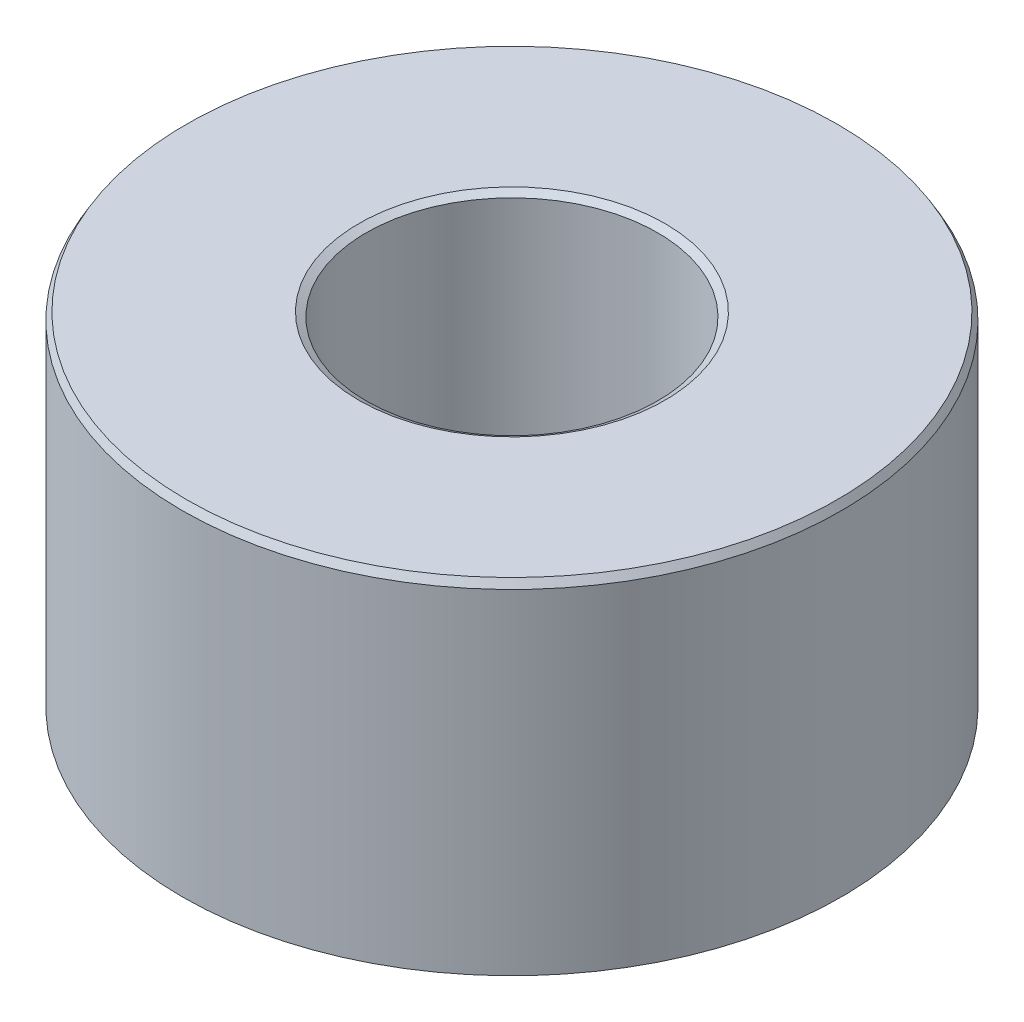
ISO-10303-21;
HEADER;
FILE_DESCRIPTION(('STEP AP214'),'2;1');
FILE_NAME('part.step','',(''),(''),'','','');
FILE_SCHEMA(('AUTOMOTIVE_DESIGN { 1 0 10303 214 1 1 1 1 }'));
ENDSEC;
DATA;
#1=APPLICATION_CONTEXT('core data for automotive mechanical design processes');
#2=APPLICATION_PROTOCOL_DEFINITION('international standard','automotive_design',2000,#1);
#3=PRODUCT_CONTEXT('',#1,'mechanical');
#4=PRODUCT('Part','Part','',(#3));
#5=PRODUCT_RELATED_PRODUCT_CATEGORY('part','',(#4));
#6=PRODUCT_DEFINITION_FORMATION('','',#4);
#7=PRODUCT_DEFINITION_CONTEXT('part definition',#1,'design');
#8=PRODUCT_DEFINITION('design','',#6,#7);
#9=PRODUCT_DEFINITION_SHAPE('','',#8);
#10=(LENGTH_UNIT() NAMED_UNIT(*) SI_UNIT(.MILLI.,.METRE.));
#11=(NAMED_UNIT(*) PLANE_ANGLE_UNIT() SI_UNIT($,.RADIAN.));
#12=(NAMED_UNIT(*) SI_UNIT($,.STERADIAN.) SOLID_ANGLE_UNIT());
#13=UNCERTAINTY_MEASURE_WITH_UNIT(LENGTH_MEASURE(1.E-05),#10,'distance_accuracy_value','');
#14=(GEOMETRIC_REPRESENTATION_CONTEXT(3) GLOBAL_UNCERTAINTY_ASSIGNED_CONTEXT((#13)) GLOBAL_UNIT_ASSIGNED_CONTEXT((#10,
#11,#12)) REPRESENTATION_CONTEXT('',''));
#15=CARTESIAN_POINT('',(0.,0.,0.));
#16=DIRECTION('',(0.,0.,1.));
#17=DIRECTION('',(1.,0.,0.));
#18=AXIS2_PLACEMENT_3D('',#15,#16,#17);
#19=CARTESIAN_POINT('',(0.,44.6371348928676,0.));
#20=DIRECTION('',(0.,-1.,0.));
#21=DIRECTION('',(0.,0.,-1.));
#22=AXIS2_PLACEMENT_3D('',#19,#20,#21);
#23=CYLINDRICAL_SURFACE('',#22,42.5);
#24=CARTESIAN_POINT('',(0.,0.548543792690093,0.));
#25=DIRECTION('',(0.,1.,0.));
#26=DIRECTION('',(0.,0.,1.));
#27=AXIS2_PLACEMENT_3D('',#24,#25,#26);
#28=CIRCLE('',#27,42.5);
#29=CARTESIAN_POINT('',(0.,0.548543792690093,42.5));
#30=VERTEX_POINT('',#29);
#31=EDGE_CURVE('E10',#30,#30,#28,.T.);
#32=ORIENTED_EDGE('',*,*,#31,.T.);
#33=EDGE_LOOP('',(#32));
#34=FACE_BOUND('',#33,.T.);
#35=CARTESIAN_POINT('',(0.,43.6870291737518,0.));
#36=DIRECTION('',(0.,1.,0.));
#37=DIRECTION('',(0.,0.,1.));
#38=AXIS2_PLACEMENT_3D('',#35,#36,#37);
#39=CIRCLE('',#38,42.5);
#40=CARTESIAN_POINT('',(0.,43.6870291737518,42.5));
#41=VERTEX_POINT('',#40);
#42=EDGE_CURVE('E50',#41,#41,#39,.F.);
#43=ORIENTED_EDGE('',*,*,#42,.T.);
#44=EDGE_LOOP('',(#43));
#45=FACE_BOUND('',#44,.T.);
#46=ADVANCED_FACE('F39',(#34,#45),#23,.T.);
#47=CARTESIAN_POINT('',(0.,44.6371348928676,0.));
#48=DIRECTION('',(0.,1.,0.));
#49=DIRECTION('',(0.,0.,1.));
#50=AXIS2_PLACEMENT_3D('',#47,#48,#49);
#51=PLANE('',#50);
#52=CARTESIAN_POINT('',(0.,44.6371348928676,0.));
#53=DIRECTION('',(0.,1.,0.));
#54=DIRECTION('',(0.,0.,1.));
#55=AXIS2_PLACEMENT_3D('',#52,#53,#54);
#56=CIRCLE('',#55,19.7430580980913);
#57=CARTESIAN_POINT('',(0.,44.6371348928676,19.7430580980913));
#58=VERTEX_POINT('',#57);
#59=EDGE_CURVE('E58',#58,#58,#56,.F.);
#60=ORIENTED_EDGE('',*,*,#59,.T.);
#61=EDGE_LOOP('',(#60));
#62=FACE_BOUND('',#61,.T.);
#63=CARTESIAN_POINT('',(0.,44.6371348928676,0.));
#64=DIRECTION('',(0.,1.,0.));
#65=DIRECTION('',(0.,0.,1.));
#66=AXIS2_PLACEMENT_3D('',#63,#64,#65);
#67=CIRCLE('',#66,41.9514562073099);
#68=CARTESIAN_POINT('',(0.,44.6371348928676,41.9514562073099));
#69=VERTEX_POINT('',#68);
#70=EDGE_CURVE('E61',#69,#69,#67,.T.);
#71=ORIENTED_EDGE('',*,*,#70,.T.);
#72=EDGE_LOOP('',(#71));
#73=FACE_BOUND('',#72,.T.);
#74=ADVANCED_FACE('F88',(#62,#73),#51,.T.);
#75=CARTESIAN_POINT('',(0.,0.,0.));
#76=DIRECTION('',(0.,1.,0.));
#77=DIRECTION('',(0.,0.,1.));
#78=AXIS2_PLACEMENT_3D('',#75,#76,#77);
#79=PLANE('',#78);
#80=CARTESIAN_POINT('',(0.,0.,0.));
#81=DIRECTION('',(0.,1.,0.));
#82=DIRECTION('',(0.,0.,1.));
#83=AXIS2_PLACEMENT_3D('',#80,#81,#82);
#84=CIRCLE('',#83,19.3414961716656);
#85=CARTESIAN_POINT('',(0.,0.,19.3414961716656));
#86=VERTEX_POINT('',#85);
#87=EDGE_CURVE('E51',#86,#86,#84,.T.);
#88=ORIENTED_EDGE('',*,*,#87,.T.);
#89=EDGE_LOOP('',(#88));
#90=FACE_BOUND('',#89,.T.);
#91=CARTESIAN_POINT('',(0.,0.,0.));
#92=DIRECTION('',(0.,1.,0.));
#93=DIRECTION('',(0.,0.,1.));
#94=AXIS2_PLACEMENT_3D('',#91,#92,#93);
#95=CIRCLE('',#94,41.5498942808842);
#96=CARTESIAN_POINT('',(0.,0.,41.5498942808842));
#97=VERTEX_POINT('',#96);
#98=EDGE_CURVE('E54',#97,#97,#95,.F.);
#99=ORIENTED_EDGE('',*,*,#98,.T.);
#100=EDGE_LOOP('',(#99));
#101=FACE_BOUND('',#100,.T.);
#102=ADVANCED_FACE('F83',(#90,#101),#79,.F.);
#103=CARTESIAN_POINT('',(0.,44.6371348928676,0.));
#104=DIRECTION('',(0.,-1.,0.));
#105=DIRECTION('',(0.,0.,-1.));
#106=AXIS2_PLACEMENT_3D('',#103,#104,#105);
#107=CYLINDRICAL_SURFACE('',#106,18.7929523789754);
#108=CARTESIAN_POINT('',(0.,44.0885911001775,0.));
#109=DIRECTION('',(0.,1.,0.));
#110=DIRECTION('',(0.,0.,1.));
#111=AXIS2_PLACEMENT_3D('',#108,#109,#110);
#112=CIRCLE('',#111,18.7929523789754);
#113=CARTESIAN_POINT('',(0.,44.0885911001775,18.7929523789754));
#114=VERTEX_POINT('',#113);
#115=EDGE_CURVE('E67',#114,#114,#112,.T.);
#116=ORIENTED_EDGE('',*,*,#115,.T.);
#117=EDGE_LOOP('',(#116));
#118=FACE_BOUND('',#117,.T.);
#119=CARTESIAN_POINT('',(0.,0.950105719115801,0.));
#120=DIRECTION('',(0.,1.,0.));
#121=DIRECTION('',(0.,0.,1.));
#122=AXIS2_PLACEMENT_3D('',#119,#120,#121);
#123=CIRCLE('',#122,18.7929523789754);
#124=CARTESIAN_POINT('',(0.,0.950105719115801,18.7929523789754));
#125=VERTEX_POINT('',#124);
#126=EDGE_CURVE('E69',#125,#125,#123,.F.);
#127=ORIENTED_EDGE('',*,*,#126,.T.);
#128=EDGE_LOOP('',(#127));
#129=FACE_BOUND('',#128,.T.);
#130=ADVANCED_FACE('F71',(#118,#129),#107,.F.);
#131=CARTESIAN_POINT('',(0.,44.0885911001775,0.));
#132=DIRECTION('',(0.,1.,0.));
#133=DIRECTION('',(0.,0.,1.));
#134=AXIS2_PLACEMENT_3D('',#131,#132,#133);
#135=CONICAL_SURFACE('',#134,18.7929523789754,1.04719755119659);
#136=ORIENTED_EDGE('',*,*,#59,.F.);
#137=EDGE_LOOP('',(#136));
#138=FACE_BOUND('',#137,.T.);
#139=ORIENTED_EDGE('',*,*,#115,.F.);
#140=EDGE_LOOP('',(#139));
#141=FACE_BOUND('',#140,.T.);
#142=ADVANCED_FACE('F77',(#138,#141),#135,.F.);
#143=CARTESIAN_POINT('',(0.,0.,0.));
#144=DIRECTION('',(0.,-1.,0.));
#145=DIRECTION('',(0.,0.,-1.));
#146=AXIS2_PLACEMENT_3D('',#143,#144,#145);
#147=CONICAL_SURFACE('',#146,19.3414961716656,0.523598775598298);
#148=ORIENTED_EDGE('',*,*,#126,.F.);
#149=EDGE_LOOP('',(#148));
#150=FACE_BOUND('',#149,.T.);
#151=ORIENTED_EDGE('',*,*,#87,.F.);
#152=EDGE_LOOP('',(#151));
#153=FACE_BOUND('',#152,.T.);
#154=ADVANCED_FACE('F73',(#150,#153),#147,.F.);
#155=CARTESIAN_POINT('',(0.,0.548543792690093,0.));
#156=DIRECTION('',(0.,1.,0.));
#157=DIRECTION('',(0.,0.,1.));
#158=AXIS2_PLACEMENT_3D('',#155,#156,#157);
#159=CONICAL_SURFACE('',#158,42.5,1.0471975511966);
#160=ORIENTED_EDGE('',*,*,#98,.F.);
#161=EDGE_LOOP('',(#160));
#162=FACE_BOUND('',#161,.T.);
#163=ORIENTED_EDGE('',*,*,#31,.F.);
#164=EDGE_LOOP('',(#163));
#165=FACE_BOUND('',#164,.T.);
#166=ADVANCED_FACE('F76',(#162,#165),#159,.T.);
#167=CARTESIAN_POINT('',(0.,44.6371348928676,0.));
#168=DIRECTION('',(0.,-1.,0.));
#169=DIRECTION('',(0.,0.,-1.));
#170=AXIS2_PLACEMENT_3D('',#167,#168,#169);
#171=CONICAL_SURFACE('',#170,41.9514562073099,0.523598775598294);
#172=ORIENTED_EDGE('',*,*,#42,.F.);
#173=EDGE_LOOP('',(#172));
#174=FACE_BOUND('',#173,.T.);
#175=ORIENTED_EDGE('',*,*,#70,.F.);
#176=EDGE_LOOP('',(#175));
#177=FACE_BOUND('',#176,.T.);
#178=ADVANCED_FACE('F45',(#174,#177),#171,.T.);
#179=CLOSED_SHELL('',(#46,#74,#102,#130,#142,#154,#166,#178));
#180=MANIFOLD_SOLID_BREP('B2',#179);
#181=ADVANCED_BREP_SHAPE_REPRESENTATION('',(#18,#180),#14);
#182=SHAPE_DEFINITION_REPRESENTATION(#9,#181);
ENDSEC;
END-ISO-10303-21;
